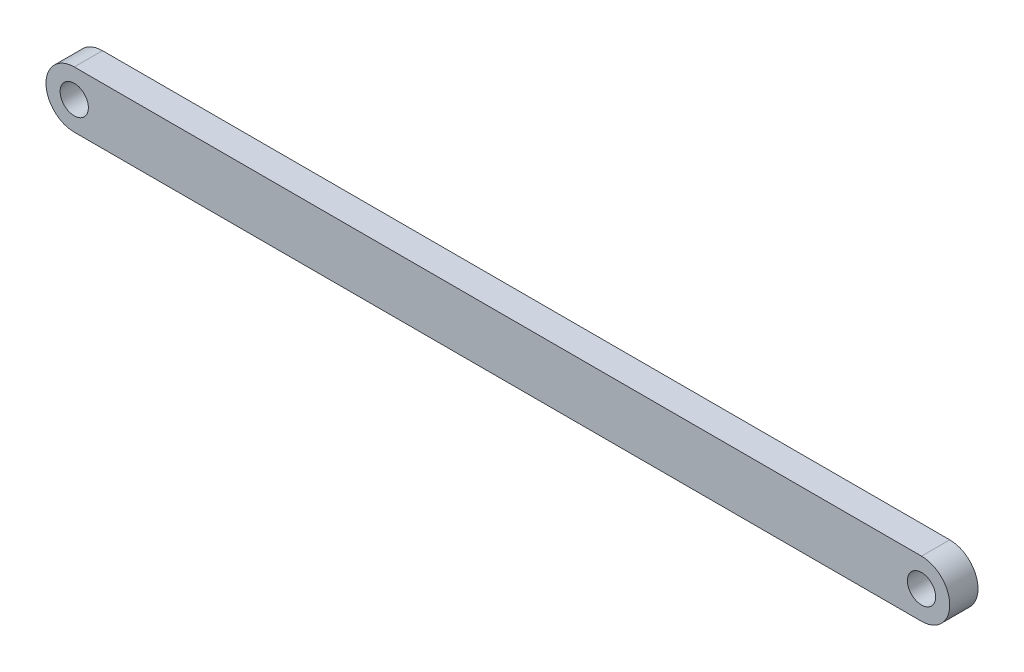
ISO-10303-21;
HEADER;
FILE_DESCRIPTION(('STEP AP214'),'2;1');
FILE_NAME('part.step','',(''),(''),'','','');
FILE_SCHEMA(('AUTOMOTIVE_DESIGN { 1 0 10303 214 1 1 1 1 }'));
ENDSEC;
DATA;
#1=APPLICATION_CONTEXT('core data for automotive mechanical design processes');
#2=APPLICATION_PROTOCOL_DEFINITION('international standard','automotive_design',2000,#1);
#3=PRODUCT_CONTEXT('',#1,'mechanical');
#4=PRODUCT('Part','Part','',(#3));
#5=PRODUCT_RELATED_PRODUCT_CATEGORY('part','',(#4));
#6=PRODUCT_DEFINITION_FORMATION('','',#4);
#7=PRODUCT_DEFINITION_CONTEXT('part definition',#1,'design');
#8=PRODUCT_DEFINITION('design','',#6,#7);
#9=PRODUCT_DEFINITION_SHAPE('','',#8);
#10=(LENGTH_UNIT() NAMED_UNIT(*) SI_UNIT(.MILLI.,.METRE.));
#11=(NAMED_UNIT(*) PLANE_ANGLE_UNIT() SI_UNIT($,.RADIAN.));
#12=(NAMED_UNIT(*) SI_UNIT($,.STERADIAN.) SOLID_ANGLE_UNIT());
#13=UNCERTAINTY_MEASURE_WITH_UNIT(LENGTH_MEASURE(1.E-05),#10,'distance_accuracy_value','');
#14=(GEOMETRIC_REPRESENTATION_CONTEXT(3) GLOBAL_UNCERTAINTY_ASSIGNED_CONTEXT((#13)) GLOBAL_UNIT_ASSIGNED_CONTEXT((#10,
#11,#12)) REPRESENTATION_CONTEXT('',''));
#15=CARTESIAN_POINT('',(0.,0.,0.));
#16=DIRECTION('',(0.,0.,1.));
#17=DIRECTION('',(1.,0.,0.));
#18=AXIS2_PLACEMENT_3D('',#15,#16,#17);
#19=CARTESIAN_POINT('',(75.0000000000002,0.,5.));
#20=DIRECTION('',(0.,0.,-1.));
#21=DIRECTION('',(-1.,0.,0.));
#22=AXIS2_PLACEMENT_3D('',#19,#20,#21);
#23=PLANE('',#22);
#24=CARTESIAN_POINT('',(75.0000000000002,0.,5.));
#25=DIRECTION('',(0.,0.,1.));
#26=DIRECTION('',(-1.,0.,0.));
#27=AXIS2_PLACEMENT_3D('',#24,#25,#26);
#28=CIRCLE('',#27,5.);
#29=CARTESIAN_POINT('',(75.0000000000002,-5.,5.));
#30=VERTEX_POINT('',#29);
#31=CARTESIAN_POINT('',(75.0000000000002,5.,5.));
#32=VERTEX_POINT('',#31);
#33=EDGE_CURVE('E92',#30,#32,#28,.T.);
#34=ORIENTED_EDGE('',*,*,#33,.T.);
#35=DIRECTION('',(-1.,0.,0.));
#36=VECTOR('',#35,1.);
#37=CARTESIAN_POINT('',(-74.9999999999998,5.,5.));
#38=LINE('',#37,#36);
#39=CARTESIAN_POINT('',(-74.9999999999998,5.,5.));
#40=VERTEX_POINT('',#39);
#41=EDGE_CURVE('E87',#32,#40,#38,.T.);
#42=ORIENTED_EDGE('',*,*,#41,.T.);
#43=CARTESIAN_POINT('',(-74.9999999999998,0.,5.));
#44=DIRECTION('',(0.,0.,1.));
#45=DIRECTION('',(1.,0.,0.));
#46=AXIS2_PLACEMENT_3D('',#43,#44,#45);
#47=CIRCLE('',#46,5.);
#48=CARTESIAN_POINT('',(-74.9999999999998,-5.,5.));
#49=VERTEX_POINT('',#48);
#50=EDGE_CURVE('E90',#40,#49,#47,.T.);
#51=ORIENTED_EDGE('',*,*,#50,.T.);
#52=DIRECTION('',(1.,0.,0.));
#53=VECTOR('',#52,1.);
#54=CARTESIAN_POINT('',(-74.9999999999998,-5.,5.));
#55=LINE('',#54,#53);
#56=EDGE_CURVE('E57',#49,#30,#55,.T.);
#57=ORIENTED_EDGE('',*,*,#56,.T.);
#58=EDGE_LOOP('',(#34,#42,#51,#57));
#59=FACE_BOUND('',#58,.T.);
#60=CARTESIAN_POINT('',(-74.9999999999998,0.,5.));
#61=DIRECTION('',(0.,0.,1.));
#62=DIRECTION('',(1.,0.,0.));
#63=AXIS2_PLACEMENT_3D('',#60,#61,#62);
#64=CIRCLE('',#63,2.5);
#65=CARTESIAN_POINT('',(-72.4999999999998,0.,5.));
#66=VERTEX_POINT('',#65);
#67=EDGE_CURVE('E112',#66,#66,#64,.T.);
#68=ORIENTED_EDGE('',*,*,#67,.F.);
#69=EDGE_LOOP('',(#68));
#70=FACE_BOUND('',#69,.T.);
#71=CARTESIAN_POINT('',(75.0000000000002,0.,5.));
#72=DIRECTION('',(0.,0.,1.));
#73=DIRECTION('',(-1.,0.,0.));
#74=AXIS2_PLACEMENT_3D('',#71,#72,#73);
#75=CIRCLE('',#74,2.49999999999998);
#76=CARTESIAN_POINT('',(72.5000000000002,0.,5.));
#77=VERTEX_POINT('',#76);
#78=EDGE_CURVE('E134',#77,#77,#75,.T.);
#79=ORIENTED_EDGE('',*,*,#78,.F.);
#80=EDGE_LOOP('',(#79));
#81=FACE_BOUND('',#80,.T.);
#82=ADVANCED_FACE('F39',(#59,#70,#81),#23,.F.);
#83=CARTESIAN_POINT('',(75.0000000000002,0.,0.));
#84=DIRECTION('',(0.,0.,-1.));
#85=DIRECTION('',(-1.,0.,0.));
#86=AXIS2_PLACEMENT_3D('',#83,#84,#85);
#87=PLANE('',#86);
#88=CARTESIAN_POINT('',(-74.9999999999998,0.,0.));
#89=DIRECTION('',(0.,0.,1.));
#90=DIRECTION('',(1.,0.,0.));
#91=AXIS2_PLACEMENT_3D('',#88,#89,#90);
#92=CIRCLE('',#91,2.5);
#93=CARTESIAN_POINT('',(-72.4999999999998,0.,0.));
#94=VERTEX_POINT('',#93);
#95=EDGE_CURVE('E130',#94,#94,#92,.T.);
#96=ORIENTED_EDGE('',*,*,#95,.T.);
#97=EDGE_LOOP('',(#96));
#98=FACE_BOUND('',#97,.T.);
#99=CARTESIAN_POINT('',(75.0000000000002,0.,0.));
#100=DIRECTION('',(0.,0.,1.));
#101=DIRECTION('',(-1.,0.,0.));
#102=AXIS2_PLACEMENT_3D('',#99,#100,#101);
#103=CIRCLE('',#102,5.);
#104=CARTESIAN_POINT('',(75.0000000000002,-5.,0.));
#105=VERTEX_POINT('',#104);
#106=CARTESIAN_POINT('',(75.0000000000002,5.,0.));
#107=VERTEX_POINT('',#106);
#108=EDGE_CURVE('E108',#105,#107,#103,.T.);
#109=ORIENTED_EDGE('',*,*,#108,.F.);
#110=DIRECTION('',(1.,0.,0.));
#111=VECTOR('',#110,1.);
#112=CARTESIAN_POINT('',(-74.9999999999998,-5.,0.));
#113=LINE('',#112,#111);
#114=CARTESIAN_POINT('',(-74.9999999999998,-5.,0.));
#115=VERTEX_POINT('',#114);
#116=EDGE_CURVE('E80',#115,#105,#113,.T.);
#117=ORIENTED_EDGE('',*,*,#116,.F.);
#118=CARTESIAN_POINT('',(-74.9999999999998,0.,0.));
#119=DIRECTION('',(0.,0.,1.));
#120=DIRECTION('',(1.,0.,0.));
#121=AXIS2_PLACEMENT_3D('',#118,#119,#120);
#122=CIRCLE('',#121,5.);
#123=CARTESIAN_POINT('',(-74.9999999999998,5.,0.));
#124=VERTEX_POINT('',#123);
#125=EDGE_CURVE('E74',#124,#115,#122,.T.);
#126=ORIENTED_EDGE('',*,*,#125,.F.);
#127=DIRECTION('',(-1.,0.,0.));
#128=VECTOR('',#127,1.);
#129=CARTESIAN_POINT('',(-74.9999999999998,5.,0.));
#130=LINE('',#129,#128);
#131=EDGE_CURVE('E97',#107,#124,#130,.T.);
#132=ORIENTED_EDGE('',*,*,#131,.F.);
#133=EDGE_LOOP('',(#109,#117,#126,#132));
#134=FACE_BOUND('',#133,.T.);
#135=CARTESIAN_POINT('',(75.0000000000002,0.,0.));
#136=DIRECTION('',(0.,0.,1.));
#137=DIRECTION('',(-1.,0.,0.));
#138=AXIS2_PLACEMENT_3D('',#135,#136,#137);
#139=CIRCLE('',#138,2.49999999999998);
#140=CARTESIAN_POINT('',(72.5000000000002,0.,0.));
#141=VERTEX_POINT('',#140);
#142=EDGE_CURVE('E138',#141,#141,#139,.T.);
#143=ORIENTED_EDGE('',*,*,#142,.T.);
#144=EDGE_LOOP('',(#143));
#145=FACE_BOUND('',#144,.T.);
#146=ADVANCED_FACE('F125',(#98,#134,#145),#87,.T.);
#147=CARTESIAN_POINT('',(75.0000000000002,0.,5.));
#148=DIRECTION('',(0.,0.,-1.));
#149=DIRECTION('',(-1.,0.,0.));
#150=AXIS2_PLACEMENT_3D('',#147,#148,#149);
#151=CYLINDRICAL_SURFACE('',#150,5.);
#152=ORIENTED_EDGE('',*,*,#108,.T.);
#153=DIRECTION('',(0.,0.,-1.));
#154=VECTOR('',#153,1.);
#155=CARTESIAN_POINT('',(75.0000000000002,5.,5.));
#156=LINE('',#155,#154);
#157=EDGE_CURVE('E11',#32,#107,#156,.T.);
#158=ORIENTED_EDGE('',*,*,#157,.F.);
#159=ORIENTED_EDGE('',*,*,#33,.F.);
#160=DIRECTION('',(0.,0.,-1.));
#161=VECTOR('',#160,1.);
#162=CARTESIAN_POINT('',(75.0000000000002,-5.,5.));
#163=LINE('',#162,#161);
#164=EDGE_CURVE('E104',#30,#105,#163,.T.);
#165=ORIENTED_EDGE('',*,*,#164,.T.);
#166=EDGE_LOOP('',(#152,#158,#159,#165));
#167=FACE_BOUND('',#166,.T.);
#168=ADVANCED_FACE('F41',(#167),#151,.T.);
#169=CARTESIAN_POINT('',(-74.9999999999998,5.,5.));
#170=DIRECTION('',(0.,-1.,0.));
#171=DIRECTION('',(0.,0.,-1.));
#172=AXIS2_PLACEMENT_3D('',#169,#170,#171);
#173=PLANE('',#172);
#174=ORIENTED_EDGE('',*,*,#131,.T.);
#175=DIRECTION('',(0.,0.,-1.));
#176=VECTOR('',#175,1.);
#177=CARTESIAN_POINT('',(-74.9999999999998,5.,5.));
#178=LINE('',#177,#176);
#179=EDGE_CURVE('E49',#40,#124,#178,.T.);
#180=ORIENTED_EDGE('',*,*,#179,.F.);
#181=ORIENTED_EDGE('',*,*,#41,.F.);
#182=ORIENTED_EDGE('',*,*,#157,.T.);
#183=EDGE_LOOP('',(#174,#180,#181,#182));
#184=FACE_BOUND('',#183,.T.);
#185=ADVANCED_FACE('F96',(#184),#173,.F.);
#186=CARTESIAN_POINT('',(-74.9999999999998,0.,5.));
#187=DIRECTION('',(0.,0.,-1.));
#188=DIRECTION('',(-1.,0.,0.));
#189=AXIS2_PLACEMENT_3D('',#186,#187,#188);
#190=CYLINDRICAL_SURFACE('',#189,5.);
#191=ORIENTED_EDGE('',*,*,#125,.T.);
#192=DIRECTION('',(0.,0.,-1.));
#193=VECTOR('',#192,1.);
#194=CARTESIAN_POINT('',(-74.9999999999998,-5.,5.));
#195=LINE('',#194,#193);
#196=EDGE_CURVE('E99',#49,#115,#195,.T.);
#197=ORIENTED_EDGE('',*,*,#196,.F.);
#198=ORIENTED_EDGE('',*,*,#50,.F.);
#199=ORIENTED_EDGE('',*,*,#179,.T.);
#200=EDGE_LOOP('',(#191,#197,#198,#199));
#201=FACE_BOUND('',#200,.T.);
#202=ADVANCED_FACE('F100',(#201),#190,.T.);
#203=CARTESIAN_POINT('',(-74.9999999999998,-5.,5.));
#204=DIRECTION('',(0.,1.,0.));
#205=DIRECTION('',(0.,0.,1.));
#206=AXIS2_PLACEMENT_3D('',#203,#204,#205);
#207=PLANE('',#206);
#208=ORIENTED_EDGE('',*,*,#116,.T.);
#209=ORIENTED_EDGE('',*,*,#164,.F.);
#210=ORIENTED_EDGE('',*,*,#56,.F.);
#211=ORIENTED_EDGE('',*,*,#196,.T.);
#212=EDGE_LOOP('',(#208,#209,#210,#211));
#213=FACE_BOUND('',#212,.T.);
#214=ADVANCED_FACE('F122',(#213),#207,.F.);
#215=CARTESIAN_POINT('',(-74.9999999999998,0.,5.));
#216=DIRECTION('',(0.,0.,-1.));
#217=DIRECTION('',(-1.,0.,0.));
#218=AXIS2_PLACEMENT_3D('',#215,#216,#217);
#219=CYLINDRICAL_SURFACE('',#218,2.5);
#220=ORIENTED_EDGE('',*,*,#67,.T.);
#221=EDGE_LOOP('',(#220));
#222=FACE_BOUND('',#221,.T.);
#223=ORIENTED_EDGE('',*,*,#95,.F.);
#224=EDGE_LOOP('',(#223));
#225=FACE_BOUND('',#224,.T.);
#226=ADVANCED_FACE('F157',(#222,#225),#219,.F.);
#227=CARTESIAN_POINT('',(75.0000000000002,0.,5.));
#228=DIRECTION('',(0.,0.,-1.));
#229=DIRECTION('',(-1.,0.,0.));
#230=AXIS2_PLACEMENT_3D('',#227,#228,#229);
#231=CYLINDRICAL_SURFACE('',#230,2.49999999999998);
#232=ORIENTED_EDGE('',*,*,#78,.T.);
#233=EDGE_LOOP('',(#232));
#234=FACE_BOUND('',#233,.T.);
#235=ORIENTED_EDGE('',*,*,#142,.F.);
#236=EDGE_LOOP('',(#235));
#237=FACE_BOUND('',#236,.T.);
#238=ADVANCED_FACE('F146',(#234,#237),#231,.F.);
#239=CLOSED_SHELL('',(#82,#146,#168,#185,#202,#214,#226,#238));
#240=MANIFOLD_SOLID_BREP('B2',#239);
#241=ADVANCED_BREP_SHAPE_REPRESENTATION('',(#18,#240),#14);
#242=SHAPE_DEFINITION_REPRESENTATION(#9,#241);
ENDSEC;
END-ISO-10303-21;
